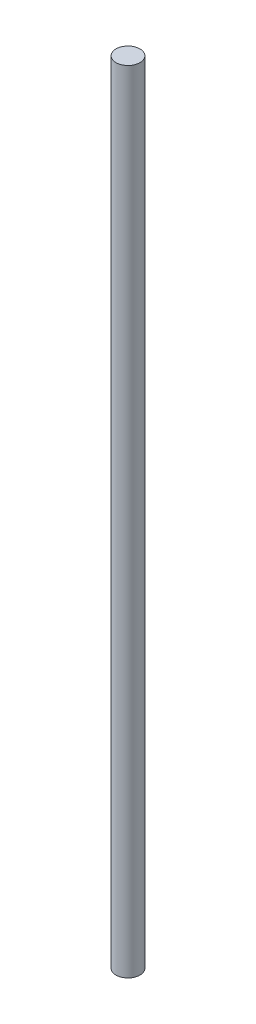
ISO-10303-21;
HEADER;
FILE_DESCRIPTION(('STEP AP214'),'2;1');
FILE_NAME('part.step','',(''),(''),'','','');
FILE_SCHEMA(('AUTOMOTIVE_DESIGN { 1 0 10303 214 1 1 1 1 }'));
ENDSEC;
DATA;
#1=APPLICATION_CONTEXT('core data for automotive mechanical design processes');
#2=APPLICATION_PROTOCOL_DEFINITION('international standard','automotive_design',2000,#1);
#3=PRODUCT_CONTEXT('',#1,'mechanical');
#4=PRODUCT('Part','Part','',(#3));
#5=PRODUCT_RELATED_PRODUCT_CATEGORY('part','',(#4));
#6=PRODUCT_DEFINITION_FORMATION('','',#4);
#7=PRODUCT_DEFINITION_CONTEXT('part definition',#1,'design');
#8=PRODUCT_DEFINITION('design','',#6,#7);
#9=PRODUCT_DEFINITION_SHAPE('','',#8);
#10=(LENGTH_UNIT() NAMED_UNIT(*) SI_UNIT(.MILLI.,.METRE.));
#11=(NAMED_UNIT(*) PLANE_ANGLE_UNIT() SI_UNIT($,.RADIAN.));
#12=(NAMED_UNIT(*) SI_UNIT($,.STERADIAN.) SOLID_ANGLE_UNIT());
#13=UNCERTAINTY_MEASURE_WITH_UNIT(LENGTH_MEASURE(1.E-05),#10,'distance_accuracy_value','');
#14=(GEOMETRIC_REPRESENTATION_CONTEXT(3) GLOBAL_UNCERTAINTY_ASSIGNED_CONTEXT((#13)) GLOBAL_UNIT_ASSIGNED_CONTEXT((#10,
#11,#12)) REPRESENTATION_CONTEXT('',''));
#15=CARTESIAN_POINT('',(0.,0.,0.));
#16=DIRECTION('',(0.,0.,1.));
#17=DIRECTION('',(1.,0.,0.));
#18=AXIS2_PLACEMENT_3D('',#15,#16,#17);
#19=CARTESIAN_POINT('',(0.,420.,0.));
#20=DIRECTION('',(0.,-1.,0.));
#21=DIRECTION('',(0.,0.,-1.));
#22=AXIS2_PLACEMENT_3D('',#19,#20,#21);
#23=CYLINDRICAL_SURFACE('',#22,6.35);
#24=CARTESIAN_POINT('',(0.,420.,0.));
#25=DIRECTION('',(0.,1.,0.));
#26=DIRECTION('',(0.,0.,1.));
#27=AXIS2_PLACEMENT_3D('',#24,#25,#26);
#28=CIRCLE('',#27,6.35);
#29=CARTESIAN_POINT('',(0.,420.,6.35));
#30=VERTEX_POINT('',#29);
#31=EDGE_CURVE('E10',#30,#30,#28,.T.);
#32=ORIENTED_EDGE('',*,*,#31,.F.);
#33=EDGE_LOOP('',(#32));
#34=FACE_BOUND('',#33,.T.);
#35=CARTESIAN_POINT('',(0.,0.,0.));
#36=DIRECTION('',(0.,1.,0.));
#37=DIRECTION('',(0.,0.,1.));
#38=AXIS2_PLACEMENT_3D('',#35,#36,#37);
#39=CIRCLE('',#38,6.35);
#40=CARTESIAN_POINT('',(0.,0.,6.35));
#41=VERTEX_POINT('',#40);
#42=EDGE_CURVE('E34',#41,#41,#39,.T.);
#43=ORIENTED_EDGE('',*,*,#42,.T.);
#44=EDGE_LOOP('',(#43));
#45=FACE_BOUND('',#44,.T.);
#46=ADVANCED_FACE('F31',(#34,#45),#23,.T.);
#47=CARTESIAN_POINT('',(0.,420.,0.));
#48=DIRECTION('',(0.,1.,0.));
#49=DIRECTION('',(0.,0.,1.));
#50=AXIS2_PLACEMENT_3D('',#47,#48,#49);
#51=PLANE('',#50);
#52=ORIENTED_EDGE('',*,*,#31,.T.);
#53=EDGE_LOOP('',(#52));
#54=FACE_BOUND('',#53,.T.);
#55=ADVANCED_FACE('F46',(#54),#51,.T.);
#56=CARTESIAN_POINT('',(0.,0.,0.));
#57=DIRECTION('',(0.,1.,0.));
#58=DIRECTION('',(0.,0.,1.));
#59=AXIS2_PLACEMENT_3D('',#56,#57,#58);
#60=PLANE('',#59);
#61=ORIENTED_EDGE('',*,*,#42,.F.);
#62=EDGE_LOOP('',(#61));
#63=FACE_BOUND('',#62,.T.);
#64=ADVANCED_FACE('F44',(#63),#60,.F.);
#65=CLOSED_SHELL('',(#46,#55,#64));
#66=MANIFOLD_SOLID_BREP('B2',#65);
#67=ADVANCED_BREP_SHAPE_REPRESENTATION('',(#18,#66),#14);
#68=SHAPE_DEFINITION_REPRESENTATION(#9,#67);
ENDSEC;
END-ISO-10303-21;
